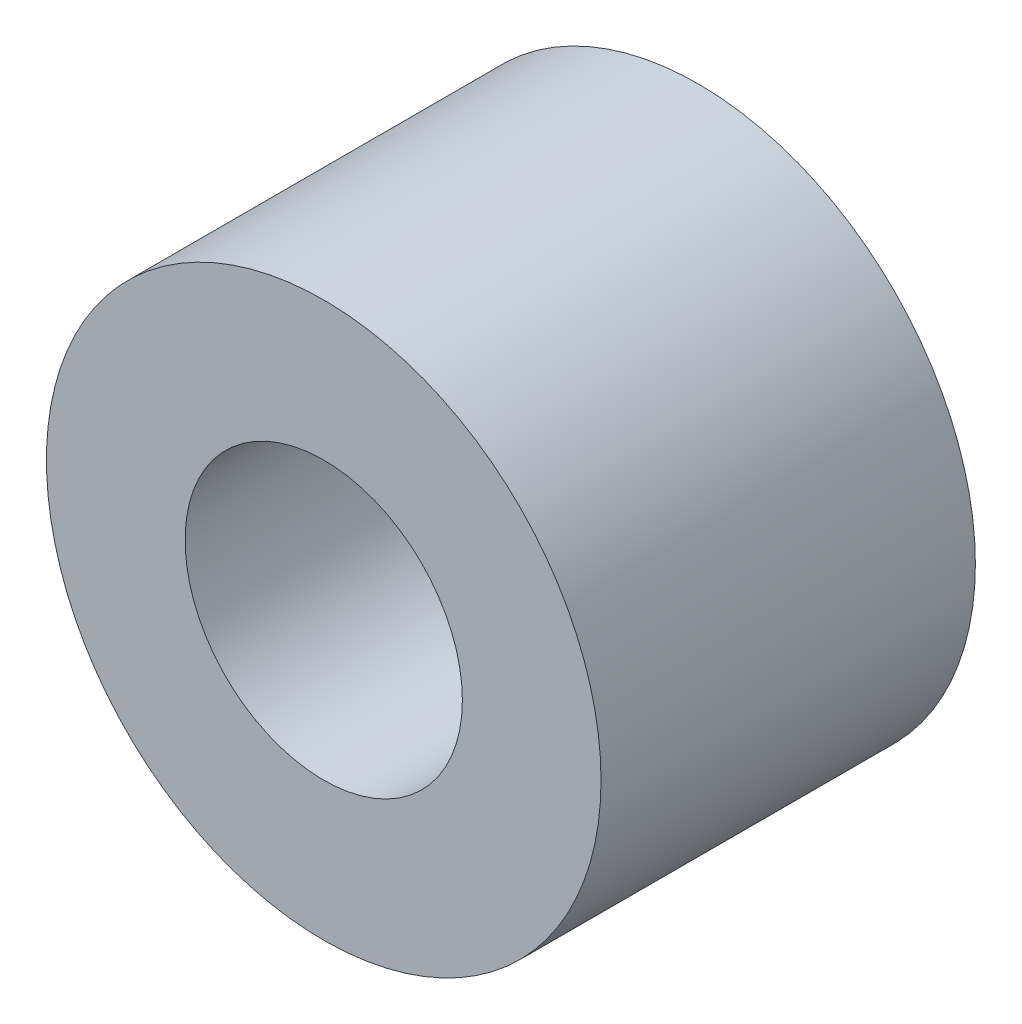
ISO-10303-21;
HEADER;
FILE_DESCRIPTION(('STEP AP214'),'2;1');
FILE_NAME('part.step','',(''),(''),'','','');
FILE_SCHEMA(('AUTOMOTIVE_DESIGN { 1 0 10303 214 1 1 1 1 }'));
ENDSEC;
DATA;
#1=APPLICATION_CONTEXT('core data for automotive mechanical design processes');
#2=APPLICATION_PROTOCOL_DEFINITION('international standard','automotive_design',2000,#1);
#3=PRODUCT_CONTEXT('',#1,'mechanical');
#4=PRODUCT('Part','Part','',(#3));
#5=PRODUCT_RELATED_PRODUCT_CATEGORY('part','',(#4));
#6=PRODUCT_DEFINITION_FORMATION('','',#4);
#7=PRODUCT_DEFINITION_CONTEXT('part definition',#1,'design');
#8=PRODUCT_DEFINITION('design','',#6,#7);
#9=PRODUCT_DEFINITION_SHAPE('','',#8);
#10=(LENGTH_UNIT() NAMED_UNIT(*) SI_UNIT(.MILLI.,.METRE.));
#11=(NAMED_UNIT(*) PLANE_ANGLE_UNIT() SI_UNIT($,.RADIAN.));
#12=(NAMED_UNIT(*) SI_UNIT($,.STERADIAN.) SOLID_ANGLE_UNIT());
#13=UNCERTAINTY_MEASURE_WITH_UNIT(LENGTH_MEASURE(1.E-05),#10,'distance_accuracy_value','');
#14=(GEOMETRIC_REPRESENTATION_CONTEXT(3) GLOBAL_UNCERTAINTY_ASSIGNED_CONTEXT((#13)) GLOBAL_UNIT_ASSIGNED_CONTEXT((#10,
#11,#12)) REPRESENTATION_CONTEXT('',''));
#15=CARTESIAN_POINT('',(0.,0.,0.));
#16=DIRECTION('',(0.,0.,1.));
#17=DIRECTION('',(1.,0.,0.));
#18=AXIS2_PLACEMENT_3D('',#15,#16,#17);
#19=CARTESIAN_POINT('',(0.,0.,2.7));
#20=DIRECTION('',(0.,0.,1.));
#21=DIRECTION('',(1.,0.,0.));
#22=AXIS2_PLACEMENT_3D('',#19,#20,#21);
#23=PLANE('',#22);
#24=CARTESIAN_POINT('',(0.,0.,2.7));
#25=DIRECTION('',(0.,0.,1.));
#26=DIRECTION('',(1.,0.,0.));
#27=AXIS2_PLACEMENT_3D('',#24,#25,#26);
#28=CIRCLE('',#27,2.);
#29=CARTESIAN_POINT('',(2.,0.,2.7));
#30=VERTEX_POINT('',#29);
#31=EDGE_CURVE('E10',#30,#30,#28,.T.);
#32=ORIENTED_EDGE('',*,*,#31,.T.);
#33=EDGE_LOOP('',(#32));
#34=FACE_BOUND('',#33,.T.);
#35=CARTESIAN_POINT('',(0.,0.,2.7));
#36=DIRECTION('',(0.,0.,1.));
#37=DIRECTION('',(1.,0.,0.));
#38=AXIS2_PLACEMENT_3D('',#35,#36,#37);
#39=CIRCLE('',#38,1.);
#40=CARTESIAN_POINT('',(1.,0.,2.7));
#41=VERTEX_POINT('',#40);
#42=EDGE_CURVE('E50',#41,#41,#39,.T.);
#43=ORIENTED_EDGE('',*,*,#42,.F.);
#44=EDGE_LOOP('',(#43));
#45=FACE_BOUND('',#44,.T.);
#46=ADVANCED_FACE('F39',(#34,#45),#23,.T.);
#47=CARTESIAN_POINT('',(0.,0.,0.));
#48=DIRECTION('',(0.,0.,1.));
#49=DIRECTION('',(1.,0.,0.));
#50=AXIS2_PLACEMENT_3D('',#47,#48,#49);
#51=PLANE('',#50);
#52=CARTESIAN_POINT('',(0.,0.,0.));
#53=DIRECTION('',(0.,0.,1.));
#54=DIRECTION('',(1.,0.,0.));
#55=AXIS2_PLACEMENT_3D('',#52,#53,#54);
#56=CIRCLE('',#55,2.);
#57=CARTESIAN_POINT('',(2.,0.,0.));
#58=VERTEX_POINT('',#57);
#59=EDGE_CURVE('E43',#58,#58,#56,.T.);
#60=ORIENTED_EDGE('',*,*,#59,.F.);
#61=EDGE_LOOP('',(#60));
#62=FACE_BOUND('',#61,.T.);
#63=CARTESIAN_POINT('',(0.,0.,0.));
#64=DIRECTION('',(0.,0.,1.));
#65=DIRECTION('',(1.,0.,0.));
#66=AXIS2_PLACEMENT_3D('',#63,#64,#65);
#67=CIRCLE('',#66,1.);
#68=CARTESIAN_POINT('',(1.,0.,0.));
#69=VERTEX_POINT('',#68);
#70=EDGE_CURVE('E52',#69,#69,#67,.T.);
#71=ORIENTED_EDGE('',*,*,#70,.T.);
#72=EDGE_LOOP('',(#71));
#73=FACE_BOUND('',#72,.T.);
#74=ADVANCED_FACE('F62',(#62,#73),#51,.F.);
#75=CARTESIAN_POINT('',(0.,0.,2.7));
#76=DIRECTION('',(0.,0.,-1.));
#77=DIRECTION('',(-1.,0.,0.));
#78=AXIS2_PLACEMENT_3D('',#75,#76,#77);
#79=CYLINDRICAL_SURFACE('',#78,2.);
#80=ORIENTED_EDGE('',*,*,#31,.F.);
#81=EDGE_LOOP('',(#80));
#82=FACE_BOUND('',#81,.T.);
#83=ORIENTED_EDGE('',*,*,#59,.T.);
#84=EDGE_LOOP('',(#83));
#85=FACE_BOUND('',#84,.T.);
#86=ADVANCED_FACE('F41',(#82,#85),#79,.T.);
#87=CARTESIAN_POINT('',(0.,0.,2.7));
#88=DIRECTION('',(0.,0.,-1.));
#89=DIRECTION('',(-1.,0.,0.));
#90=AXIS2_PLACEMENT_3D('',#87,#88,#89);
#91=CYLINDRICAL_SURFACE('',#90,1.);
#92=ORIENTED_EDGE('',*,*,#42,.T.);
#93=EDGE_LOOP('',(#92));
#94=FACE_BOUND('',#93,.T.);
#95=ORIENTED_EDGE('',*,*,#70,.F.);
#96=EDGE_LOOP('',(#95));
#97=FACE_BOUND('',#96,.T.);
#98=ADVANCED_FACE('F58',(#94,#97),#91,.F.);
#99=CLOSED_SHELL('',(#46,#74,#86,#98));
#100=MANIFOLD_SOLID_BREP('B2',#99);
#101=ADVANCED_BREP_SHAPE_REPRESENTATION('',(#18,#100),#14);
#102=SHAPE_DEFINITION_REPRESENTATION(#9,#101);
ENDSEC;
END-ISO-10303-21;
